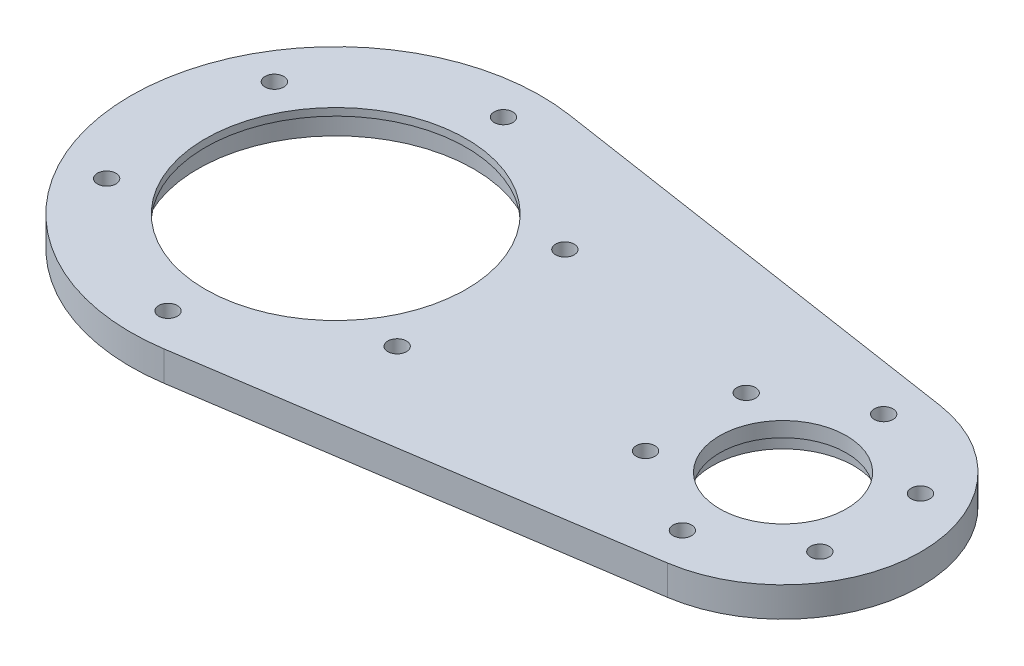
ISO-10303-21;
HEADER;
FILE_DESCRIPTION(('STEP AP214'),'2;1');
FILE_NAME('part.step','',(''),(''),'','','');
FILE_SCHEMA(('AUTOMOTIVE_DESIGN { 1 0 10303 214 1 1 1 1 }'));
ENDSEC;
DATA;
#1=APPLICATION_CONTEXT('core data for automotive mechanical design processes');
#2=APPLICATION_PROTOCOL_DEFINITION('international standard','automotive_design',2000,#1);
#3=PRODUCT_CONTEXT('',#1,'mechanical');
#4=PRODUCT('Part','Part','',(#3));
#5=PRODUCT_RELATED_PRODUCT_CATEGORY('part','',(#4));
#6=PRODUCT_DEFINITION_FORMATION('','',#4);
#7=PRODUCT_DEFINITION_CONTEXT('part definition',#1,'design');
#8=PRODUCT_DEFINITION('design','',#6,#7);
#9=PRODUCT_DEFINITION_SHAPE('','',#8);
#10=(LENGTH_UNIT() NAMED_UNIT(*) SI_UNIT(.MILLI.,.METRE.));
#11=(NAMED_UNIT(*) PLANE_ANGLE_UNIT() SI_UNIT($,.RADIAN.));
#12=(NAMED_UNIT(*) SI_UNIT($,.STERADIAN.) SOLID_ANGLE_UNIT());
#13=UNCERTAINTY_MEASURE_WITH_UNIT(LENGTH_MEASURE(1.E-05),#10,'distance_accuracy_value','');
#14=(GEOMETRIC_REPRESENTATION_CONTEXT(3) GLOBAL_UNCERTAINTY_ASSIGNED_CONTEXT((#13)) GLOBAL_UNIT_ASSIGNED_CONTEXT((#10,
#11,#12)) REPRESENTATION_CONTEXT('',''));
#15=CARTESIAN_POINT('',(0.,0.,0.));
#16=DIRECTION('',(0.,0.,1.));
#17=DIRECTION('',(1.,0.,0.));
#18=AXIS2_PLACEMENT_3D('',#15,#16,#17);
#19=CARTESIAN_POINT('',(0.,10.,0.));
#20=DIRECTION('',(0.,1.,0.));
#21=DIRECTION('',(0.,0.,1.));
#22=AXIS2_PLACEMENT_3D('',#19,#20,#21);
#23=PLANE('',#22);
#24=CARTESIAN_POINT('',(48.30865704891,10.,6.74999999999989));
#25=DIRECTION('',(0.,-1.,0.));
#26=DIRECTION('',(0.,0.,-1.));
#27=AXIS2_PLACEMENT_3D('',#24,#25,#26);
#28=CIRCLE('',#27,1.25);
#29=CARTESIAN_POINT('',(48.30865704891,10.,5.49999999999989));
#30=VERTEX_POINT('',#29);
#31=EDGE_CURVE('E237',#30,#30,#28,.T.);
#32=ORIENTED_EDGE('',*,*,#31,.T.);
#33=EDGE_LOOP('',(#32));
#34=FACE_BOUND('',#33,.T.);
#35=CARTESIAN_POINT('',(71.6913429510899,10.,6.75000000000005));
#36=DIRECTION('',(0.,-1.,0.));
#37=DIRECTION('',(0.,0.,-1.));
#38=AXIS2_PLACEMENT_3D('',#35,#36,#37);
#39=CIRCLE('',#38,1.25);
#40=CARTESIAN_POINT('',(71.6913429510899,10.,5.50000000000005));
#41=VERTEX_POINT('',#40);
#42=EDGE_CURVE('E221',#41,#41,#39,.T.);
#43=ORIENTED_EDGE('',*,*,#42,.T.);
#44=EDGE_LOOP('',(#43));
#45=FACE_BOUND('',#44,.T.);
#46=CARTESIAN_POINT('',(71.6913429510899,10.,-6.74999999999997));
#47=DIRECTION('',(0.,-1.,0.));
#48=DIRECTION('',(0.,0.,-1.));
#49=AXIS2_PLACEMENT_3D('',#46,#47,#48);
#50=CIRCLE('',#49,1.25);
#51=CARTESIAN_POINT('',(71.6913429510899,10.,-7.99999999999997));
#52=VERTEX_POINT('',#51);
#53=EDGE_CURVE('E213',#52,#52,#50,.T.);
#54=ORIENTED_EDGE('',*,*,#53,.T.);
#55=EDGE_LOOP('',(#54));
#56=FACE_BOUND('',#55,.T.);
#57=CARTESIAN_POINT('',(60.,10.,-13.5));
#58=DIRECTION('',(0.,-1.,0.));
#59=DIRECTION('',(0.,0.,-1.));
#60=AXIS2_PLACEMENT_3D('',#57,#58,#59);
#61=CIRCLE('',#60,1.25);
#62=CARTESIAN_POINT('',(60.,10.,-14.75));
#63=VERTEX_POINT('',#62);
#64=EDGE_CURVE('E205',#63,#63,#61,.T.);
#65=ORIENTED_EDGE('',*,*,#64,.T.);
#66=EDGE_LOOP('',(#65));
#67=FACE_BOUND('',#66,.T.);
#68=CARTESIAN_POINT('',(0.,10.,22.5));
#69=DIRECTION('',(0.,-1.,0.));
#70=DIRECTION('',(0.,0.,-1.));
#71=AXIS2_PLACEMENT_3D('',#68,#69,#70);
#72=CIRCLE('',#71,1.25);
#73=CARTESIAN_POINT('',(0.,10.,21.25));
#74=VERTEX_POINT('',#73);
#75=EDGE_CURVE('E181',#74,#74,#72,.T.);
#76=ORIENTED_EDGE('',*,*,#75,.T.);
#77=EDGE_LOOP('',(#76));
#78=FACE_BOUND('',#77,.T.);
#79=CARTESIAN_POINT('',(19.4855715851498,10.,11.2500000000001));
#80=DIRECTION('',(0.,-1.,0.));
#81=DIRECTION('',(0.,0.,-1.));
#82=AXIS2_PLACEMENT_3D('',#79,#80,#81);
#83=CIRCLE('',#82,1.25);
#84=CARTESIAN_POINT('',(19.4855715851498,10.,10.0000000000001));
#85=VERTEX_POINT('',#84);
#86=EDGE_CURVE('E173',#85,#85,#83,.T.);
#87=ORIENTED_EDGE('',*,*,#86,.T.);
#88=EDGE_LOOP('',(#87));
#89=FACE_BOUND('',#88,.T.);
#90=CARTESIAN_POINT('',(0.,10.,0.));
#91=DIRECTION('',(0.,1.,0.));
#92=DIRECTION('',(0.,0.,1.));
#93=AXIS2_PLACEMENT_3D('',#90,#91,#92);
#94=CIRCLE('',#93,17.5);
#95=CARTESIAN_POINT('',(0.,10.,17.5));
#96=VERTEX_POINT('',#95);
#97=EDGE_CURVE('E150',#96,#96,#94,.T.);
#98=ORIENTED_EDGE('',*,*,#97,.F.);
#99=EDGE_LOOP('',(#98));
#100=FACE_BOUND('',#99,.T.);
#101=CARTESIAN_POINT('',(0.,10.,0.));
#102=DIRECTION('',(0.,1.,0.));
#103=DIRECTION('',(0.,0.,1.));
#104=AXIS2_PLACEMENT_3D('',#101,#102,#103);
#105=CIRCLE('',#104,27.5);
#106=CARTESIAN_POINT('',(4.125,10.,-27.1888649082671));
#107=VERTEX_POINT('',#106);
#108=CARTESIAN_POINT('',(4.125,10.,27.1888649082671));
#109=VERTEX_POINT('',#108);
#110=EDGE_CURVE('E12',#107,#109,#105,.T.);
#111=ORIENTED_EDGE('',*,*,#110,.T.);
#112=DIRECTION('',(0.988685996664259,0.,-0.15));
#113=VECTOR('',#112,1.);
#114=CARTESIAN_POINT('',(4.125,10.,27.1888649082671));
#115=LINE('',#114,#113);
#116=CARTESIAN_POINT('',(62.775,10.,18.2906909382888));
#117=VERTEX_POINT('',#116);
#118=EDGE_CURVE('E106',#109,#117,#115,.T.);
#119=ORIENTED_EDGE('',*,*,#118,.T.);
#120=CARTESIAN_POINT('',(60.,10.,0.));
#121=DIRECTION('',(0.,1.,0.));
#122=DIRECTION('',(0.,0.,1.));
#123=AXIS2_PLACEMENT_3D('',#120,#121,#122);
#124=CIRCLE('',#123,18.5);
#125=CARTESIAN_POINT('',(62.775,10.,-18.2906909382888));
#126=VERTEX_POINT('',#125);
#127=EDGE_CURVE('E121',#117,#126,#124,.T.);
#128=ORIENTED_EDGE('',*,*,#127,.T.);
#129=DIRECTION('',(-0.988685996664259,0.,-0.15));
#130=VECTOR('',#129,1.);
#131=CARTESIAN_POINT('',(4.125,10.,-27.1888649082671));
#132=LINE('',#131,#130);
#133=EDGE_CURVE('E103',#126,#107,#132,.T.);
#134=ORIENTED_EDGE('',*,*,#133,.T.);
#135=EDGE_LOOP('',(#111,#119,#128,#134));
#136=FACE_BOUND('',#135,.T.);
#137=CARTESIAN_POINT('',(60.,10.,0.));
#138=DIRECTION('',(0.,-1.,0.));
#139=DIRECTION('',(0.,0.,-1.));
#140=AXIS2_PLACEMENT_3D('',#137,#138,#139);
#141=CIRCLE('',#140,8.50000000000001);
#142=CARTESIAN_POINT('',(60.,10.,-8.50000000000001));
#143=VERTEX_POINT('',#142);
#144=EDGE_CURVE('E128',#143,#143,#141,.T.);
#145=ORIENTED_EDGE('',*,*,#144,.T.);
#146=EDGE_LOOP('',(#145));
#147=FACE_BOUND('',#146,.T.);
#148=CARTESIAN_POINT('',(0.,10.,-22.5));
#149=DIRECTION('',(0.,-1.,0.));
#150=DIRECTION('',(0.,0.,-1.));
#151=AXIS2_PLACEMENT_3D('',#148,#149,#150);
#152=CIRCLE('',#151,1.25);
#153=CARTESIAN_POINT('',(0.,10.,-23.75));
#154=VERTEX_POINT('',#153);
#155=EDGE_CURVE('E154',#154,#154,#152,.T.);
#156=ORIENTED_EDGE('',*,*,#155,.T.);
#157=EDGE_LOOP('',(#156));
#158=FACE_BOUND('',#157,.T.);
#159=CARTESIAN_POINT('',(19.4855715851499,10.,-11.25));
#160=DIRECTION('',(0.,-1.,0.));
#161=DIRECTION('',(0.,0.,-1.));
#162=AXIS2_PLACEMENT_3D('',#159,#160,#161);
#163=CIRCLE('',#162,1.25);
#164=CARTESIAN_POINT('',(19.4855715851499,10.,-12.5));
#165=VERTEX_POINT('',#164);
#166=EDGE_CURVE('E165',#165,#165,#163,.T.);
#167=ORIENTED_EDGE('',*,*,#166,.T.);
#168=EDGE_LOOP('',(#167));
#169=FACE_BOUND('',#168,.T.);
#170=CARTESIAN_POINT('',(-19.48557158515,10.,11.2499999999998));
#171=DIRECTION('',(0.,-1.,0.));
#172=DIRECTION('',(0.,0.,-1.));
#173=AXIS2_PLACEMENT_3D('',#170,#171,#172);
#174=CIRCLE('',#173,1.25);
#175=CARTESIAN_POINT('',(-19.48557158515,10.,9.99999999999982));
#176=VERTEX_POINT('',#175);
#177=EDGE_CURVE('E189',#176,#176,#174,.T.);
#178=ORIENTED_EDGE('',*,*,#177,.T.);
#179=EDGE_LOOP('',(#178));
#180=FACE_BOUND('',#179,.T.);
#181=CARTESIAN_POINT('',(-19.4855715851497,10.,-11.2500000000002));
#182=DIRECTION('',(0.,-1.,0.));
#183=DIRECTION('',(0.,0.,-1.));
#184=AXIS2_PLACEMENT_3D('',#181,#182,#183);
#185=CIRCLE('',#184,1.25);
#186=CARTESIAN_POINT('',(-19.4855715851497,10.,-12.5000000000002));
#187=VERTEX_POINT('',#186);
#188=EDGE_CURVE('E197',#187,#187,#185,.T.);
#189=ORIENTED_EDGE('',*,*,#188,.T.);
#190=EDGE_LOOP('',(#189));
#191=FACE_BOUND('',#190,.T.);
#192=CARTESIAN_POINT('',(60.,10.,13.5));
#193=DIRECTION('',(0.,-1.,0.));
#194=DIRECTION('',(0.,0.,-1.));
#195=AXIS2_PLACEMENT_3D('',#192,#193,#194);
#196=CIRCLE('',#195,1.25);
#197=CARTESIAN_POINT('',(60.,10.,12.25));
#198=VERTEX_POINT('',#197);
#199=EDGE_CURVE('E229',#198,#198,#196,.T.);
#200=ORIENTED_EDGE('',*,*,#199,.T.);
#201=EDGE_LOOP('',(#200));
#202=FACE_BOUND('',#201,.T.);
#203=CARTESIAN_POINT('',(48.3086570489102,10.,-6.75000000000014));
#204=DIRECTION('',(0.,-1.,0.));
#205=DIRECTION('',(0.,0.,-1.));
#206=AXIS2_PLACEMENT_3D('',#203,#204,#205);
#207=CIRCLE('',#206,1.25);
#208=CARTESIAN_POINT('',(48.3086570489102,10.,-8.00000000000014));
#209=VERTEX_POINT('',#208);
#210=EDGE_CURVE('E245',#209,#209,#207,.T.);
#211=ORIENTED_EDGE('',*,*,#210,.T.);
#212=EDGE_LOOP('',(#211));
#213=FACE_BOUND('',#212,.T.);
#214=ADVANCED_FACE('F45',(#34,#45,#56,#67,#78,#89,#100,#136,#147,#158,#169,#180,#191,#202,#213),
#23,.T.);
#215=CARTESIAN_POINT('',(-1111.,6.,33.8225209756556));
#216=DIRECTION('',(0.,1.,0.));
#217=DIRECTION('',(0.,0.,1.));
#218=AXIS2_PLACEMENT_3D('',#215,#216,#217);
#219=PLANE('',#218);
#220=CARTESIAN_POINT('',(48.30865704891,6.,6.74999999999989));
#221=DIRECTION('',(0.,-1.,0.));
#222=DIRECTION('',(0.,0.,-1.));
#223=AXIS2_PLACEMENT_3D('',#220,#221,#222);
#224=CIRCLE('',#223,1.24999999999999);
#225=CARTESIAN_POINT('',(48.30865704891,6.,5.4999999999999));
#226=VERTEX_POINT('',#225);
#227=EDGE_CURVE('E241',#226,#226,#224,.T.);
#228=ORIENTED_EDGE('',*,*,#227,.F.);
#229=EDGE_LOOP('',(#228));
#230=FACE_BOUND('',#229,.T.);
#231=CARTESIAN_POINT('',(71.6913429510899,6.,6.75000000000005));
#232=DIRECTION('',(0.,-1.,0.));
#233=DIRECTION('',(0.,0.,-1.));
#234=AXIS2_PLACEMENT_3D('',#231,#232,#233);
#235=CIRCLE('',#234,1.24999999999999);
#236=CARTESIAN_POINT('',(71.6913429510899,6.,5.50000000000007));
#237=VERTEX_POINT('',#236);
#238=EDGE_CURVE('E225',#237,#237,#235,.T.);
#239=ORIENTED_EDGE('',*,*,#238,.F.);
#240=EDGE_LOOP('',(#239));
#241=FACE_BOUND('',#240,.T.);
#242=CARTESIAN_POINT('',(60.,6.,-13.5));
#243=DIRECTION('',(0.,-1.,0.));
#244=DIRECTION('',(0.,0.,-1.));
#245=AXIS2_PLACEMENT_3D('',#242,#243,#244);
#246=CIRCLE('',#245,1.24999999999999);
#247=CARTESIAN_POINT('',(60.,6.,-14.75));
#248=VERTEX_POINT('',#247);
#249=EDGE_CURVE('E209',#248,#248,#246,.T.);
#250=ORIENTED_EDGE('',*,*,#249,.F.);
#251=EDGE_LOOP('',(#250));
#252=FACE_BOUND('',#251,.T.);
#253=CARTESIAN_POINT('',(19.4855715851498,6.,11.2500000000001));
#254=DIRECTION('',(0.,-1.,0.));
#255=DIRECTION('',(0.,0.,-1.));
#256=AXIS2_PLACEMENT_3D('',#253,#254,#255);
#257=CIRCLE('',#256,1.24999999999999);
#258=CARTESIAN_POINT('',(19.4855715851498,6.,10.0000000000001));
#259=VERTEX_POINT('',#258);
#260=EDGE_CURVE('E177',#259,#259,#257,.T.);
#261=ORIENTED_EDGE('',*,*,#260,.F.);
#262=EDGE_LOOP('',(#261));
#263=FACE_BOUND('',#262,.T.);
#264=CARTESIAN_POINT('',(19.4855715851499,6.,-11.25));
#265=DIRECTION('',(0.,-1.,0.));
#266=DIRECTION('',(0.,0.,-1.));
#267=AXIS2_PLACEMENT_3D('',#264,#265,#266);
#268=CIRCLE('',#267,1.24999999999999);
#269=CARTESIAN_POINT('',(19.4855715851499,6.,-12.4999999999999));
#270=VERTEX_POINT('',#269);
#271=EDGE_CURVE('E169',#270,#270,#268,.T.);
#272=ORIENTED_EDGE('',*,*,#271,.F.);
#273=EDGE_LOOP('',(#272));
#274=FACE_BOUND('',#273,.T.);
#275=CARTESIAN_POINT('',(0.,6.,-22.5));
#276=DIRECTION('',(0.,-1.,0.));
#277=DIRECTION('',(0.,0.,-1.));
#278=AXIS2_PLACEMENT_3D('',#275,#276,#277);
#279=CIRCLE('',#278,1.24999999999999);
#280=CARTESIAN_POINT('',(0.,6.,-23.75));
#281=VERTEX_POINT('',#280);
#282=EDGE_CURVE('E161',#281,#281,#279,.T.);
#283=ORIENTED_EDGE('',*,*,#282,.F.);
#284=EDGE_LOOP('',(#283));
#285=FACE_BOUND('',#284,.T.);
#286=CARTESIAN_POINT('',(0.,6.,0.));
#287=DIRECTION('',(0.,1.,0.));
#288=DIRECTION('',(0.,0.,1.));
#289=AXIS2_PLACEMENT_3D('',#286,#287,#288);
#290=CIRCLE('',#289,18.5);
#291=CARTESIAN_POINT('',(0.,6.,18.5));
#292=VERTEX_POINT('',#291);
#293=EDGE_CURVE('E133',#292,#292,#290,.T.);
#294=ORIENTED_EDGE('',*,*,#293,.T.);
#295=EDGE_LOOP('',(#294));
#296=FACE_BOUND('',#295,.T.);
#297=DIRECTION('',(-0.98868599666426,0.,0.15));
#298=VECTOR('',#297,1.);
#299=CARTESIAN_POINT('',(4.125,6.,27.1888649082671));
#300=LINE('',#299,#298);
#301=CARTESIAN_POINT('',(62.775,6.,18.2906909382888));
#302=VERTEX_POINT('',#301);
#303=CARTESIAN_POINT('',(4.125,6.,27.1888649082671));
#304=VERTEX_POINT('',#303);
#305=EDGE_CURVE('E140',#302,#304,#300,.T.);
#306=ORIENTED_EDGE('',*,*,#305,.T.);
#307=CARTESIAN_POINT('',(0.,6.,0.));
#308=DIRECTION('',(0.,1.,0.));
#309=DIRECTION('',(0.,0.,1.));
#310=AXIS2_PLACEMENT_3D('',#307,#308,#309);
#311=CIRCLE('',#310,27.5);
#312=CARTESIAN_POINT('',(4.125,6.,-27.1888649082671));
#313=VERTEX_POINT('',#312);
#314=EDGE_CURVE('E62',#313,#304,#311,.T.);
#315=ORIENTED_EDGE('',*,*,#314,.F.);
#316=DIRECTION('',(0.98868599666426,0.,0.15));
#317=VECTOR('',#316,1.);
#318=CARTESIAN_POINT('',(4.125,6.,-27.1888649082671));
#319=LINE('',#318,#317);
#320=CARTESIAN_POINT('',(62.775,6.,-18.2906909382888));
#321=VERTEX_POINT('',#320);
#322=EDGE_CURVE('E86',#313,#321,#319,.T.);
#323=ORIENTED_EDGE('',*,*,#322,.T.);
#324=CARTESIAN_POINT('',(60.,6.,0.));
#325=DIRECTION('',(0.,1.,0.));
#326=DIRECTION('',(0.,0.,1.));
#327=AXIS2_PLACEMENT_3D('',#324,#325,#326);
#328=CIRCLE('',#327,18.5);
#329=EDGE_CURVE('E90',#321,#302,#328,.F.);
#330=ORIENTED_EDGE('',*,*,#329,.T.);
#331=EDGE_LOOP('',(#306,#315,#323,#330));
#332=FACE_BOUND('',#331,.T.);
#333=CARTESIAN_POINT('',(60.,6.,0.));
#334=DIRECTION('',(0.,1.,0.));
#335=DIRECTION('',(0.,0.,1.));
#336=AXIS2_PLACEMENT_3D('',#333,#334,#335);
#337=CIRCLE('',#336,9.50000000000001);
#338=CARTESIAN_POINT('',(60.,6.,9.50000000000001));
#339=VERTEX_POINT('',#338);
#340=EDGE_CURVE('E49',#339,#339,#337,.F.);
#341=ORIENTED_EDGE('',*,*,#340,.F.);
#342=EDGE_LOOP('',(#341));
#343=FACE_BOUND('',#342,.T.);
#344=CARTESIAN_POINT('',(0.,6.,22.5));
#345=DIRECTION('',(0.,-1.,0.));
#346=DIRECTION('',(0.,0.,-1.));
#347=AXIS2_PLACEMENT_3D('',#344,#345,#346);
#348=CIRCLE('',#347,1.24999999999999);
#349=CARTESIAN_POINT('',(0.,6.,21.25));
#350=VERTEX_POINT('',#349);
#351=EDGE_CURVE('E185',#350,#350,#348,.T.);
#352=ORIENTED_EDGE('',*,*,#351,.F.);
#353=EDGE_LOOP('',(#352));
#354=FACE_BOUND('',#353,.T.);
#355=CARTESIAN_POINT('',(-19.48557158515,6.,11.2499999999998));
#356=DIRECTION('',(0.,-1.,0.));
#357=DIRECTION('',(0.,0.,-1.));
#358=AXIS2_PLACEMENT_3D('',#355,#356,#357);
#359=CIRCLE('',#358,1.24999999999999);
#360=CARTESIAN_POINT('',(-19.48557158515,6.,9.99999999999983));
#361=VERTEX_POINT('',#360);
#362=EDGE_CURVE('E193',#361,#361,#359,.T.);
#363=ORIENTED_EDGE('',*,*,#362,.F.);
#364=EDGE_LOOP('',(#363));
#365=FACE_BOUND('',#364,.T.);
#366=CARTESIAN_POINT('',(-19.4855715851497,6.,-11.2500000000002));
#367=DIRECTION('',(0.,-1.,0.));
#368=DIRECTION('',(0.,0.,-1.));
#369=AXIS2_PLACEMENT_3D('',#366,#367,#368);
#370=CIRCLE('',#369,1.24999999999999);
#371=CARTESIAN_POINT('',(-19.4855715851497,6.,-12.5000000000002));
#372=VERTEX_POINT('',#371);
#373=EDGE_CURVE('E201',#372,#372,#370,.T.);
#374=ORIENTED_EDGE('',*,*,#373,.F.);
#375=EDGE_LOOP('',(#374));
#376=FACE_BOUND('',#375,.T.);
#377=CARTESIAN_POINT('',(71.6913429510899,6.,-6.74999999999997));
#378=DIRECTION('',(0.,-1.,0.));
#379=DIRECTION('',(0.,0.,-1.));
#380=AXIS2_PLACEMENT_3D('',#377,#378,#379);
#381=CIRCLE('',#380,1.24999999999999);
#382=CARTESIAN_POINT('',(71.6913429510899,6.,-7.99999999999996));
#383=VERTEX_POINT('',#382);
#384=EDGE_CURVE('E217',#383,#383,#381,.T.);
#385=ORIENTED_EDGE('',*,*,#384,.F.);
#386=EDGE_LOOP('',(#385));
#387=FACE_BOUND('',#386,.T.);
#388=CARTESIAN_POINT('',(60.,6.,13.5));
#389=DIRECTION('',(0.,-1.,0.));
#390=DIRECTION('',(0.,0.,-1.));
#391=AXIS2_PLACEMENT_3D('',#388,#389,#390);
#392=CIRCLE('',#391,1.24999999999999);
#393=CARTESIAN_POINT('',(60.,6.,12.25));
#394=VERTEX_POINT('',#393);
#395=EDGE_CURVE('E233',#394,#394,#392,.T.);
#396=ORIENTED_EDGE('',*,*,#395,.F.);
#397=EDGE_LOOP('',(#396));
#398=FACE_BOUND('',#397,.T.);
#399=CARTESIAN_POINT('',(48.3086570489102,6.,-6.75000000000014));
#400=DIRECTION('',(0.,-1.,0.));
#401=DIRECTION('',(0.,0.,-1.));
#402=AXIS2_PLACEMENT_3D('',#399,#400,#401);
#403=CIRCLE('',#402,1.24999999999999);
#404=CARTESIAN_POINT('',(48.3086570489102,6.,-8.00000000000012));
#405=VERTEX_POINT('',#404);
#406=EDGE_CURVE('E249',#405,#405,#403,.T.);
#407=ORIENTED_EDGE('',*,*,#406,.F.);
#408=EDGE_LOOP('',(#407));
#409=FACE_BOUND('',#408,.T.);
#410=ADVANCED_FACE('F88',(#230,#241,#252,#263,#274,#285,#296,#332,#343,#354,#365,#376,#387,#398,
#409),#219,.F.);
#411=CARTESIAN_POINT('',(0.,10.,0.));
#412=DIRECTION('',(0.,-1.,0.));
#413=DIRECTION('',(0.,0.,-1.));
#414=AXIS2_PLACEMENT_3D('',#411,#412,#413);
#415=CYLINDRICAL_SURFACE('',#414,18.5);
#416=ORIENTED_EDGE('',*,*,#293,.F.);
#417=EDGE_LOOP('',(#416));
#418=FACE_BOUND('',#417,.T.);
#419=CARTESIAN_POINT('',(0.,9.,0.));
#420=DIRECTION('',(0.,1.,0.));
#421=DIRECTION('',(0.,0.,1.));
#422=AXIS2_PLACEMENT_3D('',#419,#420,#421);
#423=CIRCLE('',#422,18.5);
#424=CARTESIAN_POINT('',(0.,9.,18.5));
#425=VERTEX_POINT('',#424);
#426=EDGE_CURVE('E145',#425,#425,#423,.T.);
#427=ORIENTED_EDGE('',*,*,#426,.T.);
#428=EDGE_LOOP('',(#427));
#429=FACE_BOUND('',#428,.T.);
#430=ADVANCED_FACE('F257',(#418,#429),#415,.F.);
#431=CARTESIAN_POINT('',(0.,5.,0.));
#432=DIRECTION('',(0.,-1.,0.));
#433=DIRECTION('',(0.,0.,-1.));
#434=AXIS2_PLACEMENT_3D('',#431,#432,#433);
#435=CYLINDRICAL_SURFACE('',#434,27.5);
#436=DIRECTION('',(0.,1.,0.));
#437=VECTOR('',#436,1.);
#438=CARTESIAN_POINT('',(4.125,1.,-27.1888649082671));
#439=LINE('',#438,#437);
#440=EDGE_CURVE('E69',#313,#107,#439,.T.);
#441=ORIENTED_EDGE('',*,*,#440,.F.);
#442=ORIENTED_EDGE('',*,*,#314,.T.);
#443=DIRECTION('',(0.,1.,0.));
#444=VECTOR('',#443,1.);
#445=CARTESIAN_POINT('',(4.125,1.,27.1888649082671));
#446=LINE('',#445,#444);
#447=EDGE_CURVE('E110',#304,#109,#446,.T.);
#448=ORIENTED_EDGE('',*,*,#447,.T.);
#449=ORIENTED_EDGE('',*,*,#110,.F.);
#450=EDGE_LOOP('',(#441,#442,#448,#449));
#451=FACE_BOUND('',#450,.T.);
#452=ADVANCED_FACE('F47',(#451),#435,.T.);
#453=CARTESIAN_POINT('',(60.,1.,0.));
#454=DIRECTION('',(0.,1.,0.));
#455=DIRECTION('',(0.,0.,1.));
#456=AXIS2_PLACEMENT_3D('',#453,#454,#455);
#457=CYLINDRICAL_SURFACE('',#456,18.5);
#458=ORIENTED_EDGE('',*,*,#329,.F.);
#459=DIRECTION('',(0.,1.,0.));
#460=VECTOR('',#459,1.);
#461=CARTESIAN_POINT('',(62.775,1.,-18.2906909382888));
#462=LINE('',#461,#460);
#463=EDGE_CURVE('E99',#321,#126,#462,.T.);
#464=ORIENTED_EDGE('',*,*,#463,.T.);
#465=ORIENTED_EDGE('',*,*,#127,.F.);
#466=DIRECTION('',(0.,1.,0.));
#467=VECTOR('',#466,1.);
#468=CARTESIAN_POINT('',(62.775,1.,18.2906909382888));
#469=LINE('',#468,#467);
#470=EDGE_CURVE('E55',#302,#117,#469,.T.);
#471=ORIENTED_EDGE('',*,*,#470,.F.);
#472=EDGE_LOOP('',(#458,#464,#465,#471));
#473=FACE_BOUND('',#472,.T.);
#474=ADVANCED_FACE('F97',(#473),#457,.T.);
#475=CARTESIAN_POINT('',(4.125,1.,27.1888649082671));
#476=DIRECTION('',(0.15,0.,0.988685996664259));
#477=DIRECTION('',(0.98868599666426,0.,-0.15));
#478=AXIS2_PLACEMENT_3D('',#475,#476,#477);
#479=PLANE('',#478);
#480=ORIENTED_EDGE('',*,*,#305,.F.);
#481=ORIENTED_EDGE('',*,*,#470,.T.);
#482=ORIENTED_EDGE('',*,*,#118,.F.);
#483=ORIENTED_EDGE('',*,*,#447,.F.);
#484=EDGE_LOOP('',(#480,#481,#482,#483));
#485=FACE_BOUND('',#484,.T.);
#486=ADVANCED_FACE('F285',(#485),#479,.T.);
#487=CARTESIAN_POINT('',(4.125,1.,-27.1888649082671));
#488=DIRECTION('',(0.15,0.,-0.988685996664259));
#489=DIRECTION('',(-0.98868599666426,0.,-0.15));
#490=AXIS2_PLACEMENT_3D('',#487,#488,#489);
#491=PLANE('',#490);
#492=ORIENTED_EDGE('',*,*,#322,.F.);
#493=ORIENTED_EDGE('',*,*,#440,.T.);
#494=ORIENTED_EDGE('',*,*,#133,.F.);
#495=ORIENTED_EDGE('',*,*,#463,.F.);
#496=EDGE_LOOP('',(#492,#493,#494,#495));
#497=FACE_BOUND('',#496,.T.);
#498=ADVANCED_FACE('F102',(#497),#491,.T.);
#499=CARTESIAN_POINT('',(60.,8.,0.));
#500=DIRECTION('',(0.,-1.,0.));
#501=DIRECTION('',(0.,0.,-1.));
#502=AXIS2_PLACEMENT_3D('',#499,#500,#501);
#503=CYLINDRICAL_SURFACE('',#502,9.50000000000001);
#504=ORIENTED_EDGE('',*,*,#340,.T.);
#505=EDGE_LOOP('',(#504));
#506=FACE_BOUND('',#505,.T.);
#507=CARTESIAN_POINT('',(60.,8.,0.));
#508=DIRECTION('',(0.,-1.,0.));
#509=DIRECTION('',(0.,0.,-1.));
#510=AXIS2_PLACEMENT_3D('',#507,#508,#509);
#511=CIRCLE('',#510,9.50000000000001);
#512=CARTESIAN_POINT('',(60.,8.,-9.50000000000001));
#513=VERTEX_POINT('',#512);
#514=EDGE_CURVE('E124',#513,#513,#511,.T.);
#515=ORIENTED_EDGE('',*,*,#514,.F.);
#516=EDGE_LOOP('',(#515));
#517=FACE_BOUND('',#516,.T.);
#518=ADVANCED_FACE('F280',(#506,#517),#503,.F.);
#519=CARTESIAN_POINT('',(60.,8.,0.));
#520=DIRECTION('',(0.,-1.,0.));
#521=DIRECTION('',(0.,0.,-1.));
#522=AXIS2_PLACEMENT_3D('',#519,#520,#521);
#523=PLANE('',#522);
#524=CARTESIAN_POINT('',(60.,8.,0.));
#525=DIRECTION('',(0.,-1.,0.));
#526=DIRECTION('',(0.,0.,-1.));
#527=AXIS2_PLACEMENT_3D('',#524,#525,#526);
#528=CIRCLE('',#527,8.50000000000001);
#529=CARTESIAN_POINT('',(60.,8.,-8.50000000000001));
#530=VERTEX_POINT('',#529);
#531=EDGE_CURVE('E129',#530,#530,#528,.T.);
#532=ORIENTED_EDGE('',*,*,#531,.F.);
#533=EDGE_LOOP('',(#532));
#534=FACE_BOUND('',#533,.T.);
#535=ORIENTED_EDGE('',*,*,#514,.T.);
#536=EDGE_LOOP('',(#535));
#537=FACE_BOUND('',#536,.T.);
#538=ADVANCED_FACE('F276',(#534,#537),#523,.T.);
#539=CARTESIAN_POINT('',(60.,10.,0.));
#540=DIRECTION('',(0.,-1.,0.));
#541=DIRECTION('',(0.,0.,-1.));
#542=AXIS2_PLACEMENT_3D('',#539,#540,#541);
#543=CYLINDRICAL_SURFACE('',#542,8.50000000000001);
#544=ORIENTED_EDGE('',*,*,#144,.F.);
#545=EDGE_LOOP('',(#544));
#546=FACE_BOUND('',#545,.T.);
#547=ORIENTED_EDGE('',*,*,#531,.T.);
#548=EDGE_LOOP('',(#547));
#549=FACE_BOUND('',#548,.T.);
#550=ADVANCED_FACE('F273',(#546,#549),#543,.F.);
#551=CARTESIAN_POINT('',(0.,9.,0.));
#552=DIRECTION('',(0.,1.,0.));
#553=DIRECTION('',(0.,0.,1.));
#554=AXIS2_PLACEMENT_3D('',#551,#552,#553);
#555=PLANE('',#554);
#556=CARTESIAN_POINT('',(0.,9.,0.));
#557=DIRECTION('',(0.,1.,0.));
#558=DIRECTION('',(0.,0.,1.));
#559=AXIS2_PLACEMENT_3D('',#556,#557,#558);
#560=CIRCLE('',#559,17.5);
#561=CARTESIAN_POINT('',(0.,9.,17.5));
#562=VERTEX_POINT('',#561);
#563=EDGE_CURVE('E149',#562,#562,#560,.T.);
#564=ORIENTED_EDGE('',*,*,#563,.T.);
#565=EDGE_LOOP('',(#564));
#566=FACE_BOUND('',#565,.T.);
#567=ORIENTED_EDGE('',*,*,#426,.F.);
#568=EDGE_LOOP('',(#567));
#569=FACE_BOUND('',#568,.T.);
#570=ADVANCED_FACE('F271',(#566,#569),#555,.F.);
#571=CARTESIAN_POINT('',(0.,9.,0.));
#572=DIRECTION('',(0.,1.,0.));
#573=DIRECTION('',(0.,0.,1.));
#574=AXIS2_PLACEMENT_3D('',#571,#572,#573);
#575=CYLINDRICAL_SURFACE('',#574,17.5);
#576=ORIENTED_EDGE('',*,*,#563,.F.);
#577=EDGE_LOOP('',(#576));
#578=FACE_BOUND('',#577,.T.);
#579=ORIENTED_EDGE('',*,*,#97,.T.);
#580=EDGE_LOOP('',(#579));
#581=FACE_BOUND('',#580,.T.);
#582=ADVANCED_FACE('F364',(#578,#581),#575,.F.);
#583=CARTESIAN_POINT('',(0.,6.,-22.5));
#584=DIRECTION('',(0.,-1.,0.));
#585=DIRECTION('',(0.,0.,-1.));
#586=AXIS2_PLACEMENT_3D('',#583,#584,#585);
#587=CYLINDRICAL_SURFACE('',#586,1.24999999999999);
#588=ORIENTED_EDGE('',*,*,#155,.F.);
#589=EDGE_LOOP('',(#588));
#590=FACE_BOUND('',#589,.T.);
#591=ORIENTED_EDGE('',*,*,#282,.T.);
#592=EDGE_LOOP('',(#591));
#593=FACE_BOUND('',#592,.T.);
#594=ADVANCED_FACE('F361',(#590,#593),#587,.F.);
#595=CARTESIAN_POINT('',(19.4855715851499,6.,-11.25));
#596=DIRECTION('',(0.,-1.,0.));
#597=DIRECTION('',(0.,0.,-1.));
#598=AXIS2_PLACEMENT_3D('',#595,#596,#597);
#599=CYLINDRICAL_SURFACE('',#598,1.24999999999999);
#600=ORIENTED_EDGE('',*,*,#166,.F.);
#601=EDGE_LOOP('',(#600));
#602=FACE_BOUND('',#601,.T.);
#603=ORIENTED_EDGE('',*,*,#271,.T.);
#604=EDGE_LOOP('',(#603));
#605=FACE_BOUND('',#604,.T.);
#606=ADVANCED_FACE('F357',(#602,#605),#599,.F.);
#607=CARTESIAN_POINT('',(19.4855715851498,6.,11.2500000000001));
#608=DIRECTION('',(0.,-1.,0.));
#609=DIRECTION('',(0.,0.,-1.));
#610=AXIS2_PLACEMENT_3D('',#607,#608,#609);
#611=CYLINDRICAL_SURFACE('',#610,1.24999999999999);
#612=ORIENTED_EDGE('',*,*,#86,.F.);
#613=EDGE_LOOP('',(#612));
#614=FACE_BOUND('',#613,.T.);
#615=ORIENTED_EDGE('',*,*,#260,.T.);
#616=EDGE_LOOP('',(#615));
#617=FACE_BOUND('',#616,.T.);
#618=ADVANCED_FACE('F353',(#614,#617),#611,.F.);
#619=CARTESIAN_POINT('',(0.,6.,22.5));
#620=DIRECTION('',(0.,-1.,0.));
#621=DIRECTION('',(0.,0.,-1.));
#622=AXIS2_PLACEMENT_3D('',#619,#620,#621);
#623=CYLINDRICAL_SURFACE('',#622,1.24999999999999);
#624=ORIENTED_EDGE('',*,*,#75,.F.);
#625=EDGE_LOOP('',(#624));
#626=FACE_BOUND('',#625,.T.);
#627=ORIENTED_EDGE('',*,*,#351,.T.);
#628=EDGE_LOOP('',(#627));
#629=FACE_BOUND('',#628,.T.);
#630=ADVANCED_FACE('F349',(#626,#629),#623,.F.);
#631=CARTESIAN_POINT('',(-19.48557158515,6.,11.2499999999998));
#632=DIRECTION('',(0.,-1.,0.));
#633=DIRECTION('',(0.,0.,-1.));
#634=AXIS2_PLACEMENT_3D('',#631,#632,#633);
#635=CYLINDRICAL_SURFACE('',#634,1.24999999999999);
#636=ORIENTED_EDGE('',*,*,#177,.F.);
#637=EDGE_LOOP('',(#636));
#638=FACE_BOUND('',#637,.T.);
#639=ORIENTED_EDGE('',*,*,#362,.T.);
#640=EDGE_LOOP('',(#639));
#641=FACE_BOUND('',#640,.T.);
#642=ADVANCED_FACE('F345',(#638,#641),#635,.F.);
#643=CARTESIAN_POINT('',(-19.4855715851497,6.,-11.2500000000002));
#644=DIRECTION('',(0.,-1.,0.));
#645=DIRECTION('',(0.,0.,-1.));
#646=AXIS2_PLACEMENT_3D('',#643,#644,#645);
#647=CYLINDRICAL_SURFACE('',#646,1.24999999999999);
#648=ORIENTED_EDGE('',*,*,#188,.F.);
#649=EDGE_LOOP('',(#648));
#650=FACE_BOUND('',#649,.T.);
#651=ORIENTED_EDGE('',*,*,#373,.T.);
#652=EDGE_LOOP('',(#651));
#653=FACE_BOUND('',#652,.T.);
#654=ADVANCED_FACE('F341',(#650,#653),#647,.F.);
#655=CARTESIAN_POINT('',(60.,6.,-13.5));
#656=DIRECTION('',(0.,-1.,0.));
#657=DIRECTION('',(0.,0.,-1.));
#658=AXIS2_PLACEMENT_3D('',#655,#656,#657);
#659=CYLINDRICAL_SURFACE('',#658,1.24999999999999);
#660=ORIENTED_EDGE('',*,*,#64,.F.);
#661=EDGE_LOOP('',(#660));
#662=FACE_BOUND('',#661,.T.);
#663=ORIENTED_EDGE('',*,*,#249,.T.);
#664=EDGE_LOOP('',(#663));
#665=FACE_BOUND('',#664,.T.);
#666=ADVANCED_FACE('F337',(#662,#665),#659,.F.);
#667=CARTESIAN_POINT('',(71.6913429510899,6.,-6.74999999999997));
#668=DIRECTION('',(0.,-1.,0.));
#669=DIRECTION('',(0.,0.,-1.));
#670=AXIS2_PLACEMENT_3D('',#667,#668,#669);
#671=CYLINDRICAL_SURFACE('',#670,1.24999999999999);
#672=ORIENTED_EDGE('',*,*,#53,.F.);
#673=EDGE_LOOP('',(#672));
#674=FACE_BOUND('',#673,.T.);
#675=ORIENTED_EDGE('',*,*,#384,.T.);
#676=EDGE_LOOP('',(#675));
#677=FACE_BOUND('',#676,.T.);
#678=ADVANCED_FACE('F333',(#674,#677),#671,.F.);
#679=CARTESIAN_POINT('',(71.6913429510899,6.,6.75000000000005));
#680=DIRECTION('',(0.,-1.,0.));
#681=DIRECTION('',(0.,0.,-1.));
#682=AXIS2_PLACEMENT_3D('',#679,#680,#681);
#683=CYLINDRICAL_SURFACE('',#682,1.24999999999999);
#684=ORIENTED_EDGE('',*,*,#42,.F.);
#685=EDGE_LOOP('',(#684));
#686=FACE_BOUND('',#685,.T.);
#687=ORIENTED_EDGE('',*,*,#238,.T.);
#688=EDGE_LOOP('',(#687));
#689=FACE_BOUND('',#688,.T.);
#690=ADVANCED_FACE('F329',(#686,#689),#683,.F.);
#691=CARTESIAN_POINT('',(60.,6.,13.5));
#692=DIRECTION('',(0.,-1.,0.));
#693=DIRECTION('',(0.,0.,-1.));
#694=AXIS2_PLACEMENT_3D('',#691,#692,#693);
#695=CYLINDRICAL_SURFACE('',#694,1.24999999999999);
#696=ORIENTED_EDGE('',*,*,#199,.F.);
#697=EDGE_LOOP('',(#696));
#698=FACE_BOUND('',#697,.T.);
#699=ORIENTED_EDGE('',*,*,#395,.T.);
#700=EDGE_LOOP('',(#699));
#701=FACE_BOUND('',#700,.T.);
#702=ADVANCED_FACE('F323',(#698,#701),#695,.F.);
#703=CARTESIAN_POINT('',(48.30865704891,6.,6.74999999999989));
#704=DIRECTION('',(0.,-1.,0.));
#705=DIRECTION('',(0.,0.,-1.));
#706=AXIS2_PLACEMENT_3D('',#703,#704,#705);
#707=CYLINDRICAL_SURFACE('',#706,1.24999999999999);
#708=ORIENTED_EDGE('',*,*,#31,.F.);
#709=EDGE_LOOP('',(#708));
#710=FACE_BOUND('',#709,.T.);
#711=ORIENTED_EDGE('',*,*,#227,.T.);
#712=EDGE_LOOP('',(#711));
#713=FACE_BOUND('',#712,.T.);
#714=ADVANCED_FACE('F318',(#710,#713),#707,.F.);
#715=CARTESIAN_POINT('',(48.3086570489102,6.,-6.75000000000014));
#716=DIRECTION('',(0.,-1.,0.));
#717=DIRECTION('',(0.,0.,-1.));
#718=AXIS2_PLACEMENT_3D('',#715,#716,#717);
#719=CYLINDRICAL_SURFACE('',#718,1.24999999999999);
#720=ORIENTED_EDGE('',*,*,#210,.F.);
#721=EDGE_LOOP('',(#720));
#722=FACE_BOUND('',#721,.T.);
#723=ORIENTED_EDGE('',*,*,#406,.T.);
#724=EDGE_LOOP('',(#723));
#725=FACE_BOUND('',#724,.T.);
#726=ADVANCED_FACE('F254',(#722,#725),#719,.F.);
#727=CLOSED_SHELL('',(#214,#410,#430,#452,#474,#486,#498,#518,#538,#550,#570,#582,#594,#606,
#618,#630,#642,#654,#666,#678,#690,#702,#714,#726));
#728=MANIFOLD_SOLID_BREP('B2',#727);
#729=ADVANCED_BREP_SHAPE_REPRESENTATION('',(#18,#728),#14);
#730=SHAPE_DEFINITION_REPRESENTATION(#9,#729);
ENDSEC;
END-ISO-10303-21;
